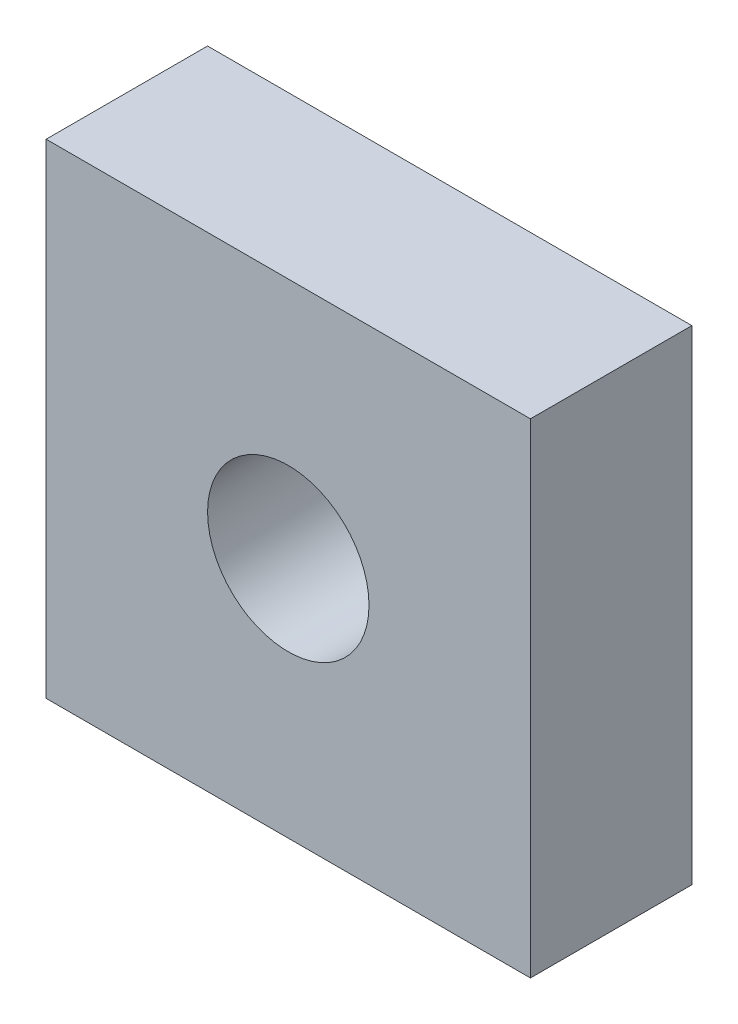
ISO-10303-21;
HEADER;
FILE_DESCRIPTION(('STEP AP214'),'2;1');
FILE_NAME('part.step','',(''),(''),'','','');
FILE_SCHEMA(('AUTOMOTIVE_DESIGN { 1 0 10303 214 1 1 1 1 }'));
ENDSEC;
DATA;
#1=APPLICATION_CONTEXT('core data for automotive mechanical design processes');
#2=APPLICATION_PROTOCOL_DEFINITION('international standard','automotive_design',2000,#1);
#3=PRODUCT_CONTEXT('',#1,'mechanical');
#4=PRODUCT('Part','Part','',(#3));
#5=PRODUCT_RELATED_PRODUCT_CATEGORY('part','',(#4));
#6=PRODUCT_DEFINITION_FORMATION('','',#4);
#7=PRODUCT_DEFINITION_CONTEXT('part definition',#1,'design');
#8=PRODUCT_DEFINITION('design','',#6,#7);
#9=PRODUCT_DEFINITION_SHAPE('','',#8);
#10=(LENGTH_UNIT() NAMED_UNIT(*) SI_UNIT(.MILLI.,.METRE.));
#11=(NAMED_UNIT(*) PLANE_ANGLE_UNIT() SI_UNIT($,.RADIAN.));
#12=(NAMED_UNIT(*) SI_UNIT($,.STERADIAN.) SOLID_ANGLE_UNIT());
#13=UNCERTAINTY_MEASURE_WITH_UNIT(LENGTH_MEASURE(1.E-05),#10,'distance_accuracy_value','');
#14=(GEOMETRIC_REPRESENTATION_CONTEXT(3) GLOBAL_UNCERTAINTY_ASSIGNED_CONTEXT((#13)) GLOBAL_UNIT_ASSIGNED_CONTEXT((#10,
#11,#12)) REPRESENTATION_CONTEXT('',''));
#15=CARTESIAN_POINT('',(0.,0.,0.));
#16=DIRECTION('',(0.,0.,1.));
#17=DIRECTION('',(1.,0.,0.));
#18=AXIS2_PLACEMENT_3D('',#15,#16,#17);
#19=CARTESIAN_POINT('',(0.,0.,10.));
#20=DIRECTION('',(0.,0.,1.));
#21=DIRECTION('',(1.,0.,0.));
#22=AXIS2_PLACEMENT_3D('',#19,#20,#21);
#23=PLANE('',#22);
#24=DIRECTION('',(0.,-1.,0.));
#25=VECTOR('',#24,1.);
#26=CARTESIAN_POINT('',(0.,30.,10.));
#27=LINE('',#26,#25);
#28=CARTESIAN_POINT('',(0.,30.,10.));
#29=VERTEX_POINT('',#28);
#30=CARTESIAN_POINT('',(0.,0.,10.));
#31=VERTEX_POINT('',#30);
#32=EDGE_CURVE('E92',#29,#31,#27,.T.);
#33=ORIENTED_EDGE('',*,*,#32,.T.);
#34=DIRECTION('',(1.,0.,0.));
#35=VECTOR('',#34,1.);
#36=CARTESIAN_POINT('',(0.,0.,10.));
#37=LINE('',#36,#35);
#38=CARTESIAN_POINT('',(30.,0.,10.));
#39=VERTEX_POINT('',#38);
#40=EDGE_CURVE('E87',#31,#39,#37,.T.);
#41=ORIENTED_EDGE('',*,*,#40,.T.);
#42=DIRECTION('',(0.,1.,0.));
#43=VECTOR('',#42,1.);
#44=CARTESIAN_POINT('',(30.,0.,10.));
#45=LINE('',#44,#43);
#46=CARTESIAN_POINT('',(30.,30.,10.));
#47=VERTEX_POINT('',#46);
#48=EDGE_CURVE('E90',#39,#47,#45,.T.);
#49=ORIENTED_EDGE('',*,*,#48,.T.);
#50=DIRECTION('',(-1.,0.,0.));
#51=VECTOR('',#50,1.);
#52=CARTESIAN_POINT('',(30.,30.,10.));
#53=LINE('',#52,#51);
#54=EDGE_CURVE('E57',#47,#29,#53,.T.);
#55=ORIENTED_EDGE('',*,*,#54,.T.);
#56=EDGE_LOOP('',(#33,#41,#49,#55));
#57=FACE_BOUND('',#56,.T.);
#58=CARTESIAN_POINT('',(15.,15.,10.));
#59=DIRECTION('',(0.,0.,1.));
#60=DIRECTION('',(1.,0.,0.));
#61=AXIS2_PLACEMENT_3D('',#58,#59,#60);
#62=CIRCLE('',#61,5.);
#63=CARTESIAN_POINT('',(20.,15.,10.));
#64=VERTEX_POINT('',#63);
#65=EDGE_CURVE('E112',#64,#64,#62,.T.);
#66=ORIENTED_EDGE('',*,*,#65,.F.);
#67=EDGE_LOOP('',(#66));
#68=FACE_BOUND('',#67,.T.);
#69=ADVANCED_FACE('F39',(#57,#68),#23,.T.);
#70=CARTESIAN_POINT('',(0.,0.,0.));
#71=DIRECTION('',(0.,0.,1.));
#72=DIRECTION('',(1.,0.,0.));
#73=AXIS2_PLACEMENT_3D('',#70,#71,#72);
#74=PLANE('',#73);
#75=DIRECTION('',(0.,-1.,0.));
#76=VECTOR('',#75,1.);
#77=CARTESIAN_POINT('',(0.,30.,0.));
#78=LINE('',#77,#76);
#79=CARTESIAN_POINT('',(0.,30.,0.));
#80=VERTEX_POINT('',#79);
#81=CARTESIAN_POINT('',(0.,0.,0.));
#82=VERTEX_POINT('',#81);
#83=EDGE_CURVE('E108',#80,#82,#78,.T.);
#84=ORIENTED_EDGE('',*,*,#83,.F.);
#85=DIRECTION('',(-1.,0.,0.));
#86=VECTOR('',#85,1.);
#87=CARTESIAN_POINT('',(30.,30.,0.));
#88=LINE('',#87,#86);
#89=CARTESIAN_POINT('',(30.,30.,0.));
#90=VERTEX_POINT('',#89);
#91=EDGE_CURVE('E80',#90,#80,#88,.T.);
#92=ORIENTED_EDGE('',*,*,#91,.F.);
#93=DIRECTION('',(0.,1.,0.));
#94=VECTOR('',#93,1.);
#95=CARTESIAN_POINT('',(30.,0.,0.));
#96=LINE('',#95,#94);
#97=CARTESIAN_POINT('',(30.,0.,0.));
#98=VERTEX_POINT('',#97);
#99=EDGE_CURVE('E74',#98,#90,#96,.T.);
#100=ORIENTED_EDGE('',*,*,#99,.F.);
#101=DIRECTION('',(1.,0.,0.));
#102=VECTOR('',#101,1.);
#103=CARTESIAN_POINT('',(0.,0.,0.));
#104=LINE('',#103,#102);
#105=EDGE_CURVE('E97',#82,#98,#104,.T.);
#106=ORIENTED_EDGE('',*,*,#105,.F.);
#107=EDGE_LOOP('',(#84,#92,#100,#106));
#108=FACE_BOUND('',#107,.T.);
#109=CARTESIAN_POINT('',(15.,15.,0.));
#110=DIRECTION('',(0.,0.,1.));
#111=DIRECTION('',(1.,0.,0.));
#112=AXIS2_PLACEMENT_3D('',#109,#110,#111);
#113=CIRCLE('',#112,5.);
#114=CARTESIAN_POINT('',(20.,15.,0.));
#115=VERTEX_POINT('',#114);
#116=EDGE_CURVE('E130',#115,#115,#113,.T.);
#117=ORIENTED_EDGE('',*,*,#116,.T.);
#118=EDGE_LOOP('',(#117));
#119=FACE_BOUND('',#118,.T.);
#120=ADVANCED_FACE('F125',(#108,#119),#74,.F.);
#121=CARTESIAN_POINT('',(0.,30.,10.));
#122=DIRECTION('',(1.,0.,0.));
#123=DIRECTION('',(0.,0.,-1.));
#124=AXIS2_PLACEMENT_3D('',#121,#122,#123);
#125=PLANE('',#124);
#126=ORIENTED_EDGE('',*,*,#83,.T.);
#127=DIRECTION('',(0.,0.,-1.));
#128=VECTOR('',#127,1.);
#129=CARTESIAN_POINT('',(0.,0.,10.));
#130=LINE('',#129,#128);
#131=EDGE_CURVE('E11',#31,#82,#130,.T.);
#132=ORIENTED_EDGE('',*,*,#131,.F.);
#133=ORIENTED_EDGE('',*,*,#32,.F.);
#134=DIRECTION('',(0.,0.,-1.));
#135=VECTOR('',#134,1.);
#136=CARTESIAN_POINT('',(0.,30.,10.));
#137=LINE('',#136,#135);
#138=EDGE_CURVE('E104',#29,#80,#137,.T.);
#139=ORIENTED_EDGE('',*,*,#138,.T.);
#140=EDGE_LOOP('',(#126,#132,#133,#139));
#141=FACE_BOUND('',#140,.T.);
#142=ADVANCED_FACE('F41',(#141),#125,.F.);
#143=CARTESIAN_POINT('',(0.,0.,10.));
#144=DIRECTION('',(0.,1.,0.));
#145=DIRECTION('',(0.,0.,1.));
#146=AXIS2_PLACEMENT_3D('',#143,#144,#145);
#147=PLANE('',#146);
#148=ORIENTED_EDGE('',*,*,#105,.T.);
#149=DIRECTION('',(0.,0.,-1.));
#150=VECTOR('',#149,1.);
#151=CARTESIAN_POINT('',(30.,0.,10.));
#152=LINE('',#151,#150);
#153=EDGE_CURVE('E49',#39,#98,#152,.T.);
#154=ORIENTED_EDGE('',*,*,#153,.F.);
#155=ORIENTED_EDGE('',*,*,#40,.F.);
#156=ORIENTED_EDGE('',*,*,#131,.T.);
#157=EDGE_LOOP('',(#148,#154,#155,#156));
#158=FACE_BOUND('',#157,.T.);
#159=ADVANCED_FACE('F96',(#158),#147,.F.);
#160=CARTESIAN_POINT('',(30.,0.,10.));
#161=DIRECTION('',(-1.,0.,0.));
#162=DIRECTION('',(0.,-1.,0.));
#163=AXIS2_PLACEMENT_3D('',#160,#161,#162);
#164=PLANE('',#163);
#165=ORIENTED_EDGE('',*,*,#99,.T.);
#166=DIRECTION('',(0.,0.,-1.));
#167=VECTOR('',#166,1.);
#168=CARTESIAN_POINT('',(30.,30.,10.));
#169=LINE('',#168,#167);
#170=EDGE_CURVE('E99',#47,#90,#169,.T.);
#171=ORIENTED_EDGE('',*,*,#170,.F.);
#172=ORIENTED_EDGE('',*,*,#48,.F.);
#173=ORIENTED_EDGE('',*,*,#153,.T.);
#174=EDGE_LOOP('',(#165,#171,#172,#173));
#175=FACE_BOUND('',#174,.T.);
#176=ADVANCED_FACE('F100',(#175),#164,.F.);
#177=CARTESIAN_POINT('',(30.,30.,10.));
#178=DIRECTION('',(0.,-1.,0.));
#179=DIRECTION('',(1.,0.,0.));
#180=AXIS2_PLACEMENT_3D('',#177,#178,#179);
#181=PLANE('',#180);
#182=ORIENTED_EDGE('',*,*,#91,.T.);
#183=ORIENTED_EDGE('',*,*,#138,.F.);
#184=ORIENTED_EDGE('',*,*,#54,.F.);
#185=ORIENTED_EDGE('',*,*,#170,.T.);
#186=EDGE_LOOP('',(#182,#183,#184,#185));
#187=FACE_BOUND('',#186,.T.);
#188=ADVANCED_FACE('F122',(#187),#181,.F.);
#189=CARTESIAN_POINT('',(15.,15.,10.));
#190=DIRECTION('',(0.,0.,-1.));
#191=DIRECTION('',(-1.,0.,0.));
#192=AXIS2_PLACEMENT_3D('',#189,#190,#191);
#193=CYLINDRICAL_SURFACE('',#192,5.);
#194=ORIENTED_EDGE('',*,*,#65,.T.);
#195=EDGE_LOOP('',(#194));
#196=FACE_BOUND('',#195,.T.);
#197=ORIENTED_EDGE('',*,*,#116,.F.);
#198=EDGE_LOOP('',(#197));
#199=FACE_BOUND('',#198,.T.);
#200=ADVANCED_FACE('F138',(#196,#199),#193,.F.);
#201=CLOSED_SHELL('',(#69,#120,#142,#159,#176,#188,#200));
#202=MANIFOLD_SOLID_BREP('B2',#201);
#203=ADVANCED_BREP_SHAPE_REPRESENTATION('',(#18,#202),#14);
#204=SHAPE_DEFINITION_REPRESENTATION(#9,#203);
ENDSEC;
END-ISO-10303-21;
